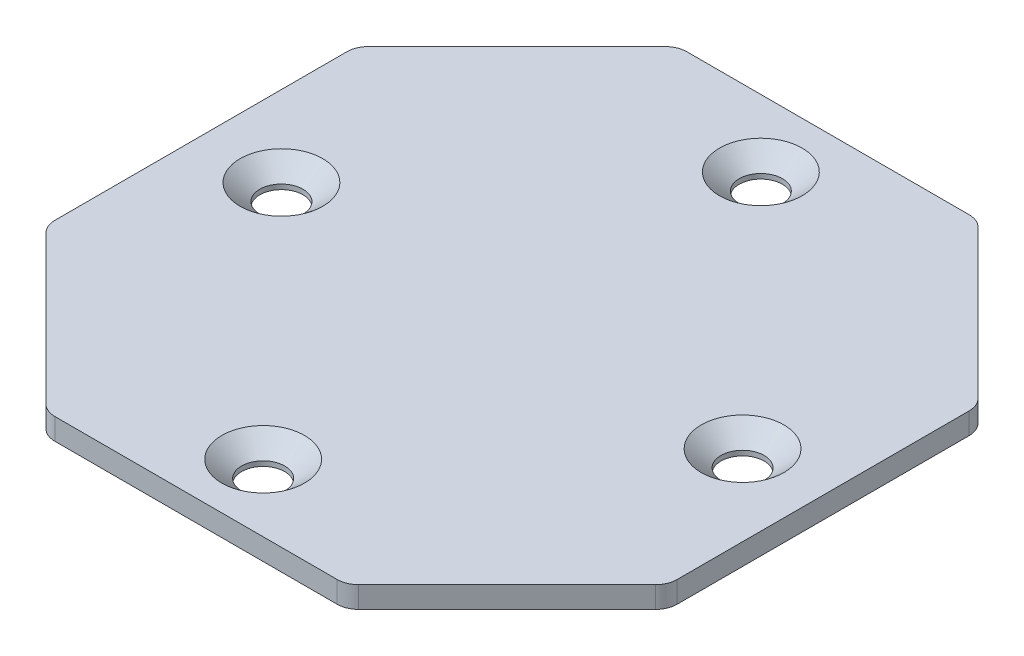
ISO-10303-21;
HEADER;
FILE_DESCRIPTION(('STEP AP214'),'2;1');
FILE_NAME('part.step','',(''),(''),'','','');
FILE_SCHEMA(('AUTOMOTIVE_DESIGN { 1 0 10303 214 1 1 1 1 }'));
ENDSEC;
DATA;
#1=APPLICATION_CONTEXT('core data for automotive mechanical design processes');
#2=APPLICATION_PROTOCOL_DEFINITION('international standard','automotive_design',2000,#1);
#3=PRODUCT_CONTEXT('',#1,'mechanical');
#4=PRODUCT('Part','Part','',(#3));
#5=PRODUCT_RELATED_PRODUCT_CATEGORY('part','',(#4));
#6=PRODUCT_DEFINITION_FORMATION('','',#4);
#7=PRODUCT_DEFINITION_CONTEXT('part definition',#1,'design');
#8=PRODUCT_DEFINITION('design','',#6,#7);
#9=PRODUCT_DEFINITION_SHAPE('','',#8);
#10=(LENGTH_UNIT() NAMED_UNIT(*) SI_UNIT(.MILLI.,.METRE.));
#11=(NAMED_UNIT(*) PLANE_ANGLE_UNIT() SI_UNIT($,.RADIAN.));
#12=(NAMED_UNIT(*) SI_UNIT($,.STERADIAN.) SOLID_ANGLE_UNIT());
#13=UNCERTAINTY_MEASURE_WITH_UNIT(LENGTH_MEASURE(1.E-05),#10,'distance_accuracy_value','');
#14=(GEOMETRIC_REPRESENTATION_CONTEXT(3) GLOBAL_UNCERTAINTY_ASSIGNED_CONTEXT((#13)) GLOBAL_UNIT_ASSIGNED_CONTEXT((#10,
#11,#12)) REPRESENTATION_CONTEXT('',''));
#15=CARTESIAN_POINT('',(0.,0.,0.));
#16=DIRECTION('',(0.,0.,1.));
#17=DIRECTION('',(1.,0.,0.));
#18=AXIS2_PLACEMENT_3D('',#15,#16,#17);
#19=CARTESIAN_POINT('',(0.,2.54,0.));
#20=DIRECTION('',(1.,0.,0.));
#21=DIRECTION('',(0.,0.,-1.));
#22=AXIS2_PLACEMENT_3D('',#19,#20,#21);
#23=PLANE('',#22);
#24=DIRECTION('',(0.,0.,1.));
#25=VECTOR('',#24,1.);
#26=CARTESIAN_POINT('',(0.,2.54,0.));
#27=LINE('',#26,#25);
#28=CARTESIAN_POINT('',(0.,2.54,-54.6478976575723));
#29=VERTEX_POINT('',#28);
#30=CARTESIAN_POINT('',(0.,2.54,-20.1021024484277));
#31=VERTEX_POINT('',#30);
#32=EDGE_CURVE('E230',#29,#31,#27,.T.);
#33=ORIENTED_EDGE('',*,*,#32,.F.);
#34=DIRECTION('',(0.,1.,0.));
#35=VECTOR('',#34,1.);
#36=CARTESIAN_POINT('',(0.,2.54,-54.6478976575723));
#37=LINE('',#36,#35);
#38=CARTESIAN_POINT('',(0.,0.,-54.6478976575723));
#39=VERTEX_POINT('',#38);
#40=EDGE_CURVE('E55',#29,#39,#37,.F.);
#41=ORIENTED_EDGE('',*,*,#40,.T.);
#42=DIRECTION('',(0.,0.,1.));
#43=VECTOR('',#42,1.);
#44=CARTESIAN_POINT('',(0.,0.,0.));
#45=LINE('',#44,#43);
#46=CARTESIAN_POINT('',(0.,0.,-20.1021024484277));
#47=VERTEX_POINT('',#46);
#48=EDGE_CURVE('E229',#39,#47,#45,.T.);
#49=ORIENTED_EDGE('',*,*,#48,.T.);
#50=DIRECTION('',(0.,1.,0.));
#51=VECTOR('',#50,1.);
#52=CARTESIAN_POINT('',(0.,2.54,-20.1021024484277));
#53=LINE('',#52,#51);
#54=EDGE_CURVE('E296',#47,#31,#53,.T.);
#55=ORIENTED_EDGE('',*,*,#54,.T.);
#56=EDGE_LOOP('',(#33,#41,#49,#55));
#57=FACE_BOUND('',#56,.T.);
#58=ADVANCED_FACE('F33',(#57),#23,.F.);
#59=CARTESIAN_POINT('',(0.,2.54,0.));
#60=DIRECTION('',(0.,0.,-1.));
#61=DIRECTION('',(-1.,0.,0.));
#62=AXIS2_PLACEMENT_3D('',#59,#60,#61);
#63=PLANE('',#62);
#64=DIRECTION('',(1.,0.,0.));
#65=VECTOR('',#64,1.);
#66=CARTESIAN_POINT('',(0.,2.54,0.));
#67=LINE('',#66,#65);
#68=CARTESIAN_POINT('',(20.1021024484277,2.54,0.));
#69=VERTEX_POINT('',#68);
#70=CARTESIAN_POINT('',(53.4978976715723,2.54,0.));
#71=VERTEX_POINT('',#70);
#72=EDGE_CURVE('E233',#69,#71,#67,.T.);
#73=ORIENTED_EDGE('',*,*,#72,.F.);
#74=DIRECTION('',(0.,1.,0.));
#75=VECTOR('',#74,1.);
#76=CARTESIAN_POINT('',(20.1021024484277,2.54,0.));
#77=LINE('',#76,#75);
#78=CARTESIAN_POINT('',(20.1021024484277,0.,0.));
#79=VERTEX_POINT('',#78);
#80=EDGE_CURVE('E11',#69,#79,#77,.F.);
#81=ORIENTED_EDGE('',*,*,#80,.T.);
#82=DIRECTION('',(1.,0.,0.));
#83=VECTOR('',#82,1.);
#84=CARTESIAN_POINT('',(0.,0.,0.));
#85=LINE('',#84,#83);
#86=CARTESIAN_POINT('',(53.4978976715723,0.,0.));
#87=VERTEX_POINT('',#86);
#88=EDGE_CURVE('E242',#79,#87,#85,.T.);
#89=ORIENTED_EDGE('',*,*,#88,.T.);
#90=DIRECTION('',(0.,1.,0.));
#91=VECTOR('',#90,1.);
#92=CARTESIAN_POINT('',(53.4978976715723,2.54,0.));
#93=LINE('',#92,#91);
#94=EDGE_CURVE('E41',#87,#71,#93,.T.);
#95=ORIENTED_EDGE('',*,*,#94,.T.);
#96=EDGE_LOOP('',(#73,#81,#89,#95));
#97=FACE_BOUND('',#96,.T.);
#98=ADVANCED_FACE('F308',(#97),#63,.F.);
#99=CARTESIAN_POINT('',(73.60000012,2.54,0.));
#100=DIRECTION('',(-1.,0.,0.));
#101=DIRECTION('',(0.,0.,1.));
#102=AXIS2_PLACEMENT_3D('',#99,#100,#101);
#103=PLANE('',#102);
#104=DIRECTION('',(0.,0.,-1.));
#105=VECTOR('',#104,1.);
#106=CARTESIAN_POINT('',(73.60000012,2.54,0.));
#107=LINE('',#106,#105);
#108=CARTESIAN_POINT('',(73.60000012,2.54,-20.1021024484277));
#109=VERTEX_POINT('',#108);
#110=CARTESIAN_POINT('',(73.60000012,2.54,-54.6478976575723));
#111=VERTEX_POINT('',#110);
#112=EDGE_CURVE('E236',#109,#111,#107,.T.);
#113=ORIENTED_EDGE('',*,*,#112,.F.);
#114=DIRECTION('',(0.,1.,0.));
#115=VECTOR('',#114,1.);
#116=CARTESIAN_POINT('',(73.60000012,2.54,-20.1021024484277));
#117=LINE('',#116,#115);
#118=CARTESIAN_POINT('',(73.60000012,0.,-20.1021024484277));
#119=VERTEX_POINT('',#118);
#120=EDGE_CURVE('E152',#109,#119,#117,.F.);
#121=ORIENTED_EDGE('',*,*,#120,.T.);
#122=DIRECTION('',(0.,0.,-1.));
#123=VECTOR('',#122,1.);
#124=CARTESIAN_POINT('',(73.60000012,0.,0.));
#125=LINE('',#124,#123);
#126=CARTESIAN_POINT('',(73.60000012,0.,-54.6478976575723));
#127=VERTEX_POINT('',#126);
#128=EDGE_CURVE('E245',#119,#127,#125,.T.);
#129=ORIENTED_EDGE('',*,*,#128,.T.);
#130=DIRECTION('',(0.,1.,0.));
#131=VECTOR('',#130,1.);
#132=CARTESIAN_POINT('',(73.60000012,2.54,-54.6478976575723));
#133=LINE('',#132,#131);
#134=EDGE_CURVE('E157',#127,#111,#133,.T.);
#135=ORIENTED_EDGE('',*,*,#134,.T.);
#136=EDGE_LOOP('',(#113,#121,#129,#135));
#137=FACE_BOUND('',#136,.T.);
#138=ADVANCED_FACE('F360',(#137),#103,.F.);
#139=CARTESIAN_POINT('',(0.,2.54,-74.750000106));
#140=DIRECTION('',(0.,0.,1.));
#141=DIRECTION('',(1.,0.,0.));
#142=AXIS2_PLACEMENT_3D('',#139,#140,#141);
#143=PLANE('',#142);
#144=DIRECTION('',(-1.,0.,0.));
#145=VECTOR('',#144,1.);
#146=CARTESIAN_POINT('',(0.,2.54,-74.750000106));
#147=LINE('',#146,#145);
#148=CARTESIAN_POINT('',(53.4978976715723,2.54,-74.750000106));
#149=VERTEX_POINT('',#148);
#150=CARTESIAN_POINT('',(20.1021024484277,2.54,-74.750000106));
#151=VERTEX_POINT('',#150);
#152=EDGE_CURVE('E238',#149,#151,#147,.T.);
#153=ORIENTED_EDGE('',*,*,#152,.F.);
#154=DIRECTION('',(0.,1.,0.));
#155=VECTOR('',#154,1.);
#156=CARTESIAN_POINT('',(53.4978976715723,2.54,-74.750000106));
#157=LINE('',#156,#155);
#158=CARTESIAN_POINT('',(53.4978976715723,0.,-74.750000106));
#159=VERTEX_POINT('',#158);
#160=EDGE_CURVE('E289',#149,#159,#157,.F.);
#161=ORIENTED_EDGE('',*,*,#160,.T.);
#162=DIRECTION('',(-1.,0.,0.));
#163=VECTOR('',#162,1.);
#164=CARTESIAN_POINT('',(0.,0.,-74.750000106));
#165=LINE('',#164,#163);
#166=CARTESIAN_POINT('',(20.1021024484277,0.,-74.750000106));
#167=VERTEX_POINT('',#166);
#168=EDGE_CURVE('E234',#159,#167,#165,.T.);
#169=ORIENTED_EDGE('',*,*,#168,.T.);
#170=DIRECTION('',(0.,1.,0.));
#171=VECTOR('',#170,1.);
#172=CARTESIAN_POINT('',(20.1021024484277,2.54,-74.750000106));
#173=LINE('',#172,#171);
#174=EDGE_CURVE('E286',#167,#151,#173,.T.);
#175=ORIENTED_EDGE('',*,*,#174,.T.);
#176=EDGE_LOOP('',(#153,#161,#169,#175));
#177=FACE_BOUND('',#176,.T.);
#178=ADVANCED_FACE('F344',(#177),#143,.F.);
#179=CARTESIAN_POINT('',(0.,2.54,0.));
#180=DIRECTION('',(0.,-1.,0.));
#181=DIRECTION('',(0.,0.,-1.));
#182=AXIS2_PLACEMENT_3D('',#179,#180,#181);
#183=PLANE('',#182);
#184=CARTESIAN_POINT('',(9.52500003,2.54,-37.375000053));
#185=DIRECTION('',(0.,1.,0.));
#186=DIRECTION('',(0.,0.,1.));
#187=AXIS2_PLACEMENT_3D('',#184,#185,#186);
#188=CIRCLE('',#187,4.8895);
#189=CARTESIAN_POINT('',(9.52500003,2.54,-32.485500053));
#190=VERTEX_POINT('',#189);
#191=EDGE_CURVE('E193',#190,#190,#188,.T.);
#192=ORIENTED_EDGE('',*,*,#191,.F.);
#193=EDGE_LOOP('',(#192));
#194=FACE_BOUND('',#193,.T.);
#195=CARTESIAN_POINT('',(36.80000006,2.54,-7.9375000265));
#196=DIRECTION('',(0.,1.,0.));
#197=DIRECTION('',(0.,0.,1.));
#198=AXIS2_PLACEMENT_3D('',#195,#196,#197);
#199=CIRCLE('',#198,4.8895);
#200=CARTESIAN_POINT('',(36.80000006,2.54,-3.0480000265));
#201=VERTEX_POINT('',#200);
#202=EDGE_CURVE('E202',#201,#201,#199,.T.);
#203=ORIENTED_EDGE('',*,*,#202,.F.);
#204=EDGE_LOOP('',(#203));
#205=FACE_BOUND('',#204,.T.);
#206=CARTESIAN_POINT('',(64.07500009,2.54,-37.375000053));
#207=DIRECTION('',(0.,1.,0.));
#208=DIRECTION('',(0.,0.,1.));
#209=AXIS2_PLACEMENT_3D('',#206,#207,#208);
#210=CIRCLE('',#209,4.88950000000001);
#211=CARTESIAN_POINT('',(64.07500009,2.54,-32.485500053));
#212=VERTEX_POINT('',#211);
#213=EDGE_CURVE('E211',#212,#212,#210,.T.);
#214=ORIENTED_EDGE('',*,*,#213,.F.);
#215=EDGE_LOOP('',(#214));
#216=FACE_BOUND('',#215,.T.);
#217=CARTESIAN_POINT('',(36.80000006,2.54,-66.8125000795));
#218=DIRECTION('',(0.,1.,0.));
#219=DIRECTION('',(0.,0.,1.));
#220=AXIS2_PLACEMENT_3D('',#217,#218,#219);
#221=CIRCLE('',#220,4.8895);
#222=CARTESIAN_POINT('',(36.80000006,2.54,-61.9230000795));
#223=VERTEX_POINT('',#222);
#224=EDGE_CURVE('E220',#223,#223,#221,.T.);
#225=ORIENTED_EDGE('',*,*,#224,.F.);
#226=EDGE_LOOP('',(#225));
#227=FACE_BOUND('',#226,.T.);
#228=DIRECTION('',(-0.707106781186547,0.,0.707106781186548));
#229=VECTOR('',#228,1.);
#230=CARTESIAN_POINT('',(73.60000012,2.54,-19.05));
#231=LINE('',#230,#229);
#232=CARTESIAN_POINT('',(72.8560513442138,2.54,-18.3060512242138));
#233=VERTEX_POINT('',#232);
#234=CARTESIAN_POINT('',(55.2939488957862,2.54,-0.743948775786166));
#235=VERTEX_POINT('',#234);
#236=EDGE_CURVE('E164',#233,#235,#231,.T.);
#237=ORIENTED_EDGE('',*,*,#236,.F.);
#238=CARTESIAN_POINT('',(71.06000012,2.54,-20.1021024484277));
#239=DIRECTION('',(0.,-1.,0.));
#240=DIRECTION('',(0.,0.,-1.));
#241=AXIS2_PLACEMENT_3D('',#238,#239,#240);
#242=CIRCLE('',#241,2.54);
#243=EDGE_CURVE('E147',#233,#109,#242,.F.);
#244=ORIENTED_EDGE('',*,*,#243,.T.);
#245=ORIENTED_EDGE('',*,*,#112,.T.);
#246=CARTESIAN_POINT('',(71.06000012,2.54,-54.6478976575723));
#247=DIRECTION('',(0.,-1.,0.));
#248=DIRECTION('',(0.,0.,-1.));
#249=AXIS2_PLACEMENT_3D('',#246,#247,#248);
#250=CIRCLE('',#249,2.54);
#251=CARTESIAN_POINT('',(72.8560513442138,2.54,-56.4439488817862));
#252=VERTEX_POINT('',#251);
#253=EDGE_CURVE('E158',#111,#252,#250,.F.);
#254=ORIENTED_EDGE('',*,*,#253,.T.);
#255=DIRECTION('',(0.707106781186548,0.,0.707106781186548));
#256=VECTOR('',#255,1.);
#257=CARTESIAN_POINT('',(73.60000012,2.54,-55.700000106));
#258=LINE('',#257,#256);
#259=CARTESIAN_POINT('',(55.2939488957862,2.54,-74.0060513302138));
#260=VERTEX_POINT('',#259);
#261=EDGE_CURVE('E178',#260,#252,#258,.T.);
#262=ORIENTED_EDGE('',*,*,#261,.F.);
#263=CARTESIAN_POINT('',(53.4978976715723,2.54,-72.210000106));
#264=DIRECTION('',(0.,-1.,0.));
#265=DIRECTION('',(0.,0.,-1.));
#266=AXIS2_PLACEMENT_3D('',#263,#264,#265);
#267=CIRCLE('',#266,2.54);
#268=EDGE_CURVE('E260',#260,#149,#267,.F.);
#269=ORIENTED_EDGE('',*,*,#268,.T.);
#270=ORIENTED_EDGE('',*,*,#152,.T.);
#271=CARTESIAN_POINT('',(20.1021024484277,2.54,-72.210000106));
#272=DIRECTION('',(0.,-1.,0.));
#273=DIRECTION('',(0.,0.,-1.));
#274=AXIS2_PLACEMENT_3D('',#271,#272,#273);
#275=CIRCLE('',#274,2.54);
#276=CARTESIAN_POINT('',(18.3060512242138,2.54,-74.0060513302138));
#277=VERTEX_POINT('',#276);
#278=EDGE_CURVE('E258',#151,#277,#275,.F.);
#279=ORIENTED_EDGE('',*,*,#278,.T.);
#280=DIRECTION('',(0.707106781186547,0.,-0.707106781186548));
#281=VECTOR('',#280,1.);
#282=CARTESIAN_POINT('',(0.,2.54,-55.700000106));
#283=LINE('',#282,#281);
#284=CARTESIAN_POINT('',(0.743948775786166,2.54,-56.4439488817862));
#285=VERTEX_POINT('',#284);
#286=EDGE_CURVE('E184',#285,#277,#283,.T.);
#287=ORIENTED_EDGE('',*,*,#286,.F.);
#288=CARTESIAN_POINT('',(2.54,2.54,-54.6478976575723));
#289=DIRECTION('',(0.,-1.,0.));
#290=DIRECTION('',(0.,0.,-1.));
#291=AXIS2_PLACEMENT_3D('',#288,#289,#290);
#292=CIRCLE('',#291,2.54);
#293=EDGE_CURVE('E256',#285,#29,#292,.F.);
#294=ORIENTED_EDGE('',*,*,#293,.T.);
#295=ORIENTED_EDGE('',*,*,#32,.T.);
#296=CARTESIAN_POINT('',(2.54,2.54,-20.1021024484277));
#297=DIRECTION('',(0.,-1.,0.));
#298=DIRECTION('',(0.,0.,-1.));
#299=AXIS2_PLACEMENT_3D('',#296,#297,#298);
#300=CIRCLE('',#299,2.54);
#301=CARTESIAN_POINT('',(0.743948775786169,2.54,-18.3060512242138));
#302=VERTEX_POINT('',#301);
#303=EDGE_CURVE('E254',#31,#302,#300,.F.);
#304=ORIENTED_EDGE('',*,*,#303,.T.);
#305=DIRECTION('',(-0.707106781186547,0.,-0.707106781186547));
#306=VECTOR('',#305,1.);
#307=CARTESIAN_POINT('',(0.,2.54,-19.05));
#308=LINE('',#307,#306);
#309=CARTESIAN_POINT('',(18.3060512242138,2.54,-0.743948775786173));
#310=VERTEX_POINT('',#309);
#311=EDGE_CURVE('E175',#310,#302,#308,.T.);
#312=ORIENTED_EDGE('',*,*,#311,.F.);
#313=CARTESIAN_POINT('',(20.1021024484277,2.54,-2.54));
#314=DIRECTION('',(0.,-1.,0.));
#315=DIRECTION('',(0.,0.,-1.));
#316=AXIS2_PLACEMENT_3D('',#313,#314,#315);
#317=CIRCLE('',#316,2.54);
#318=EDGE_CURVE('E252',#310,#69,#317,.F.);
#319=ORIENTED_EDGE('',*,*,#318,.T.);
#320=ORIENTED_EDGE('',*,*,#72,.T.);
#321=CARTESIAN_POINT('',(53.4978976715723,2.54,-2.54));
#322=DIRECTION('',(0.,-1.,0.));
#323=DIRECTION('',(0.,0.,-1.));
#324=AXIS2_PLACEMENT_3D('',#321,#322,#323);
#325=CIRCLE('',#324,2.54);
#326=EDGE_CURVE('E168',#71,#235,#325,.F.);
#327=ORIENTED_EDGE('',*,*,#326,.T.);
#328=EDGE_LOOP('',(#237,#244,#245,#254,#262,#269,#270,#279,#287,#294,#295,#304,#312,#319,#320,#327));
#329=FACE_BOUND('',#328,.T.);
#330=ADVANCED_FACE('F171',(#194,#205,#216,#227,#329),#183,.F.);
#331=CARTESIAN_POINT('',(0.,0.,0.));
#332=DIRECTION('',(0.,-1.,0.));
#333=DIRECTION('',(0.,0.,-1.));
#334=AXIS2_PLACEMENT_3D('',#331,#332,#333);
#335=PLANE('',#334);
#336=ORIENTED_EDGE('',*,*,#128,.F.);
#337=CARTESIAN_POINT('',(71.06000012,0.,-20.1021024484277));
#338=DIRECTION('',(0.,-1.,0.));
#339=DIRECTION('',(0.,0.,-1.));
#340=AXIS2_PLACEMENT_3D('',#337,#338,#339);
#341=CIRCLE('',#340,2.54);
#342=CARTESIAN_POINT('',(72.8560513442138,0.,-18.3060512242138));
#343=VERTEX_POINT('',#342);
#344=EDGE_CURVE('E279',#119,#343,#341,.T.);
#345=ORIENTED_EDGE('',*,*,#344,.T.);
#346=DIRECTION('',(-0.707106781186547,0.,0.707106781186548));
#347=VECTOR('',#346,1.);
#348=CARTESIAN_POINT('',(73.60000012,0.,-19.05));
#349=LINE('',#348,#347);
#350=CARTESIAN_POINT('',(55.2939488957862,0.,-0.743948775786162));
#351=VERTEX_POINT('',#350);
#352=EDGE_CURVE('E167',#343,#351,#349,.T.);
#353=ORIENTED_EDGE('',*,*,#352,.T.);
#354=CARTESIAN_POINT('',(53.4978976715723,0.,-2.54));
#355=DIRECTION('',(0.,-1.,0.));
#356=DIRECTION('',(0.,0.,-1.));
#357=AXIS2_PLACEMENT_3D('',#354,#355,#356);
#358=CIRCLE('',#357,2.54);
#359=EDGE_CURVE('E266',#351,#87,#358,.T.);
#360=ORIENTED_EDGE('',*,*,#359,.T.);
#361=ORIENTED_EDGE('',*,*,#88,.F.);
#362=CARTESIAN_POINT('',(20.1021024484277,0.,-2.54));
#363=DIRECTION('',(0.,-1.,0.));
#364=DIRECTION('',(0.,0.,-1.));
#365=AXIS2_PLACEMENT_3D('',#362,#363,#364);
#366=CIRCLE('',#365,2.54);
#367=CARTESIAN_POINT('',(18.3060512242138,0.,-0.743948775786166));
#368=VERTEX_POINT('',#367);
#369=EDGE_CURVE('E268',#79,#368,#366,.T.);
#370=ORIENTED_EDGE('',*,*,#369,.T.);
#371=DIRECTION('',(-0.707106781186548,0.,-0.707106781186548));
#372=VECTOR('',#371,1.);
#373=CARTESIAN_POINT('',(0.,0.,-19.05));
#374=LINE('',#373,#372);
#375=CARTESIAN_POINT('',(0.743948775786169,0.,-18.3060512242138));
#376=VERTEX_POINT('',#375);
#377=EDGE_CURVE('E191',#368,#376,#374,.T.);
#378=ORIENTED_EDGE('',*,*,#377,.T.);
#379=CARTESIAN_POINT('',(2.54,0.,-20.1021024484277));
#380=DIRECTION('',(0.,-1.,0.));
#381=DIRECTION('',(0.,0.,-1.));
#382=AXIS2_PLACEMENT_3D('',#379,#380,#381);
#383=CIRCLE('',#382,2.54);
#384=EDGE_CURVE('E48',#376,#47,#383,.T.);
#385=ORIENTED_EDGE('',*,*,#384,.T.);
#386=ORIENTED_EDGE('',*,*,#48,.F.);
#387=CARTESIAN_POINT('',(2.54,0.,-54.6478976575723));
#388=DIRECTION('',(0.,-1.,0.));
#389=DIRECTION('',(0.,0.,-1.));
#390=AXIS2_PLACEMENT_3D('',#387,#388,#389);
#391=CIRCLE('',#390,2.54);
#392=CARTESIAN_POINT('',(0.743948775786166,0.,-56.4439488817862));
#393=VERTEX_POINT('',#392);
#394=EDGE_CURVE('E271',#39,#393,#391,.T.);
#395=ORIENTED_EDGE('',*,*,#394,.T.);
#396=DIRECTION('',(0.707106781186547,0.,-0.707106781186548));
#397=VECTOR('',#396,1.);
#398=CARTESIAN_POINT('',(0.,0.,-55.700000106));
#399=LINE('',#398,#397);
#400=CARTESIAN_POINT('',(18.3060512242138,0.,-74.0060513302138));
#401=VERTEX_POINT('',#400);
#402=EDGE_CURVE('E182',#393,#401,#399,.T.);
#403=ORIENTED_EDGE('',*,*,#402,.T.);
#404=CARTESIAN_POINT('',(20.1021024484277,0.,-72.210000106));
#405=DIRECTION('',(0.,-1.,0.));
#406=DIRECTION('',(0.,0.,-1.));
#407=AXIS2_PLACEMENT_3D('',#404,#405,#406);
#408=CIRCLE('',#407,2.54);
#409=EDGE_CURVE('E273',#401,#167,#408,.T.);
#410=ORIENTED_EDGE('',*,*,#409,.T.);
#411=ORIENTED_EDGE('',*,*,#168,.F.);
#412=CARTESIAN_POINT('',(53.4978976715723,0.,-72.210000106));
#413=DIRECTION('',(0.,-1.,0.));
#414=DIRECTION('',(0.,0.,-1.));
#415=AXIS2_PLACEMENT_3D('',#412,#413,#414);
#416=CIRCLE('',#415,2.54);
#417=CARTESIAN_POINT('',(55.2939488957862,0.,-74.0060513302138));
#418=VERTEX_POINT('',#417);
#419=EDGE_CURVE('E275',#159,#418,#416,.T.);
#420=ORIENTED_EDGE('',*,*,#419,.T.);
#421=DIRECTION('',(0.707106781186548,0.,0.707106781186548));
#422=VECTOR('',#421,1.);
#423=CARTESIAN_POINT('',(73.60000012,0.,-55.700000106));
#424=LINE('',#423,#422);
#425=CARTESIAN_POINT('',(72.8560513442138,0.,-56.4439488817862));
#426=VERTEX_POINT('',#425);
#427=EDGE_CURVE('E173',#418,#426,#424,.T.);
#428=ORIENTED_EDGE('',*,*,#427,.T.);
#429=CARTESIAN_POINT('',(71.06000012,0.,-54.6478976575723));
#430=DIRECTION('',(0.,-1.,0.));
#431=DIRECTION('',(0.,0.,-1.));
#432=AXIS2_PLACEMENT_3D('',#429,#430,#431);
#433=CIRCLE('',#432,2.54);
#434=EDGE_CURVE('E277',#426,#127,#433,.T.);
#435=ORIENTED_EDGE('',*,*,#434,.T.);
#436=EDGE_LOOP('',(#336,#345,#353,#360,#361,#370,#378,#385,#386,#395,#403,#410,#411,#420,#428,#435));
#437=FACE_BOUND('',#436,.T.);
#438=CARTESIAN_POINT('',(9.52500003,0.,-37.375000053));
#439=DIRECTION('',(0.,1.,0.));
#440=DIRECTION('',(0.,0.,1.));
#441=AXIS2_PLACEMENT_3D('',#438,#439,#440);
#442=CIRCLE('',#441,2.5527);
#443=CARTESIAN_POINT('',(9.52500003,0.,-34.822300053));
#444=VERTEX_POINT('',#443);
#445=EDGE_CURVE('E199',#444,#444,#442,.T.);
#446=ORIENTED_EDGE('',*,*,#445,.T.);
#447=EDGE_LOOP('',(#446));
#448=FACE_BOUND('',#447,.T.);
#449=CARTESIAN_POINT('',(36.80000006,0.,-7.9375000265));
#450=DIRECTION('',(0.,1.,0.));
#451=DIRECTION('',(0.,0.,1.));
#452=AXIS2_PLACEMENT_3D('',#449,#450,#451);
#453=CIRCLE('',#452,2.5527);
#454=CARTESIAN_POINT('',(36.80000006,0.,-5.3848000265));
#455=VERTEX_POINT('',#454);
#456=EDGE_CURVE('E208',#455,#455,#453,.T.);
#457=ORIENTED_EDGE('',*,*,#456,.T.);
#458=EDGE_LOOP('',(#457));
#459=FACE_BOUND('',#458,.T.);
#460=CARTESIAN_POINT('',(64.07500009,0.,-37.375000053));
#461=DIRECTION('',(0.,1.,0.));
#462=DIRECTION('',(0.,0.,1.));
#463=AXIS2_PLACEMENT_3D('',#460,#461,#462);
#464=CIRCLE('',#463,2.55270000000001);
#465=CARTESIAN_POINT('',(64.07500009,0.,-34.822300053));
#466=VERTEX_POINT('',#465);
#467=EDGE_CURVE('E217',#466,#466,#464,.T.);
#468=ORIENTED_EDGE('',*,*,#467,.T.);
#469=EDGE_LOOP('',(#468));
#470=FACE_BOUND('',#469,.T.);
#471=CARTESIAN_POINT('',(36.80000006,0.,-66.8125000795));
#472=DIRECTION('',(0.,1.,0.));
#473=DIRECTION('',(0.,0.,1.));
#474=AXIS2_PLACEMENT_3D('',#471,#472,#473);
#475=CIRCLE('',#474,2.5527);
#476=CARTESIAN_POINT('',(36.80000006,0.,-64.2598000795));
#477=VERTEX_POINT('',#476);
#478=EDGE_CURVE('E226',#477,#477,#475,.T.);
#479=ORIENTED_EDGE('',*,*,#478,.T.);
#480=EDGE_LOOP('',(#479));
#481=FACE_BOUND('',#480,.T.);
#482=ADVANCED_FACE('F323',(#437,#448,#459,#470,#481),#335,.T.);
#483=CARTESIAN_POINT('',(36.80000006,2.54,-66.8125000795));
#484=DIRECTION('',(0.,1.,0.));
#485=DIRECTION('',(0.,0.,1.));
#486=AXIS2_PLACEMENT_3D('',#483,#484,#485);
#487=CYLINDRICAL_SURFACE('',#486,2.5527);
#488=ORIENTED_EDGE('',*,*,#478,.F.);
#489=EDGE_LOOP('',(#488));
#490=FACE_BOUND('',#489,.T.);
#491=CARTESIAN_POINT('',(36.80000006,0.579191981864934,-66.8125000795));
#492=DIRECTION('',(0.,1.,0.));
#493=DIRECTION('',(0.,0.,1.));
#494=AXIS2_PLACEMENT_3D('',#491,#492,#493);
#495=CIRCLE('',#494,2.5527);
#496=CARTESIAN_POINT('',(36.80000006,0.579191981864934,-64.2598000795));
#497=VERTEX_POINT('',#496);
#498=EDGE_CURVE('E223',#497,#497,#495,.T.);
#499=ORIENTED_EDGE('',*,*,#498,.T.);
#500=EDGE_LOOP('',(#499));
#501=FACE_BOUND('',#500,.T.);
#502=ADVANCED_FACE('F516',(#490,#501),#487,.F.);
#503=CARTESIAN_POINT('',(36.80000006,2.54,-66.8125000795));
#504=DIRECTION('',(0.,1.,0.));
#505=DIRECTION('',(0.,0.,1.));
#506=AXIS2_PLACEMENT_3D('',#503,#504,#505);
#507=CONICAL_SURFACE('',#506,4.8895,0.872664625997165);
#508=ORIENTED_EDGE('',*,*,#498,.F.);
#509=EDGE_LOOP('',(#508));
#510=FACE_BOUND('',#509,.T.);
#511=ORIENTED_EDGE('',*,*,#224,.T.);
#512=EDGE_LOOP('',(#511));
#513=FACE_BOUND('',#512,.T.);
#514=ADVANCED_FACE('F507',(#510,#513),#507,.F.);
#515=CARTESIAN_POINT('',(64.07500009,2.54,-37.375000053));
#516=DIRECTION('',(0.,1.,0.));
#517=DIRECTION('',(0.,0.,1.));
#518=AXIS2_PLACEMENT_3D('',#515,#516,#517);
#519=CYLINDRICAL_SURFACE('',#518,2.55270000000001);
#520=ORIENTED_EDGE('',*,*,#467,.F.);
#521=EDGE_LOOP('',(#520));
#522=FACE_BOUND('',#521,.T.);
#523=CARTESIAN_POINT('',(64.07500009,0.579191981864934,-37.375000053));
#524=DIRECTION('',(0.,1.,0.));
#525=DIRECTION('',(0.,0.,1.));
#526=AXIS2_PLACEMENT_3D('',#523,#524,#525);
#527=CIRCLE('',#526,2.55270000000001);
#528=CARTESIAN_POINT('',(64.07500009,0.579191981864934,-34.822300053));
#529=VERTEX_POINT('',#528);
#530=EDGE_CURVE('E214',#529,#529,#527,.T.);
#531=ORIENTED_EDGE('',*,*,#530,.T.);
#532=EDGE_LOOP('',(#531));
#533=FACE_BOUND('',#532,.T.);
#534=ADVANCED_FACE('F498',(#522,#533),#519,.F.);
#535=CARTESIAN_POINT('',(64.07500009,2.54,-37.375000053));
#536=DIRECTION('',(0.,1.,0.));
#537=DIRECTION('',(0.,0.,1.));
#538=AXIS2_PLACEMENT_3D('',#535,#536,#537);
#539=CONICAL_SURFACE('',#538,4.88950000000001,0.872664625997165);
#540=ORIENTED_EDGE('',*,*,#530,.F.);
#541=EDGE_LOOP('',(#540));
#542=FACE_BOUND('',#541,.T.);
#543=ORIENTED_EDGE('',*,*,#213,.T.);
#544=EDGE_LOOP('',(#543));
#545=FACE_BOUND('',#544,.T.);
#546=ADVANCED_FACE('F489',(#542,#545),#539,.F.);
#547=CARTESIAN_POINT('',(36.80000006,2.54,-7.9375000265));
#548=DIRECTION('',(0.,1.,0.));
#549=DIRECTION('',(0.,0.,1.));
#550=AXIS2_PLACEMENT_3D('',#547,#548,#549);
#551=CYLINDRICAL_SURFACE('',#550,2.5527);
#552=ORIENTED_EDGE('',*,*,#456,.F.);
#553=EDGE_LOOP('',(#552));
#554=FACE_BOUND('',#553,.T.);
#555=CARTESIAN_POINT('',(36.80000006,0.579191981864934,-7.9375000265));
#556=DIRECTION('',(0.,1.,0.));
#557=DIRECTION('',(0.,0.,1.));
#558=AXIS2_PLACEMENT_3D('',#555,#556,#557);
#559=CIRCLE('',#558,2.5527);
#560=CARTESIAN_POINT('',(36.80000006,0.579191981864934,-5.3848000265));
#561=VERTEX_POINT('',#560);
#562=EDGE_CURVE('E205',#561,#561,#559,.T.);
#563=ORIENTED_EDGE('',*,*,#562,.T.);
#564=EDGE_LOOP('',(#563));
#565=FACE_BOUND('',#564,.T.);
#566=ADVANCED_FACE('F480',(#554,#565),#551,.F.);
#567=CARTESIAN_POINT('',(36.80000006,2.54,-7.9375000265));
#568=DIRECTION('',(0.,1.,0.));
#569=DIRECTION('',(0.,0.,1.));
#570=AXIS2_PLACEMENT_3D('',#567,#568,#569);
#571=CONICAL_SURFACE('',#570,4.8895,0.872664625997165);
#572=ORIENTED_EDGE('',*,*,#562,.F.);
#573=EDGE_LOOP('',(#572));
#574=FACE_BOUND('',#573,.T.);
#575=ORIENTED_EDGE('',*,*,#202,.T.);
#576=EDGE_LOOP('',(#575));
#577=FACE_BOUND('',#576,.T.);
#578=ADVANCED_FACE('F471',(#574,#577),#571,.F.);
#579=CARTESIAN_POINT('',(9.52500003,2.54,-37.375000053));
#580=DIRECTION('',(0.,1.,0.));
#581=DIRECTION('',(0.,0.,1.));
#582=AXIS2_PLACEMENT_3D('',#579,#580,#581);
#583=CYLINDRICAL_SURFACE('',#582,2.5527);
#584=ORIENTED_EDGE('',*,*,#445,.F.);
#585=EDGE_LOOP('',(#584));
#586=FACE_BOUND('',#585,.T.);
#587=CARTESIAN_POINT('',(9.52500003,0.579191981864934,-37.375000053));
#588=DIRECTION('',(0.,1.,0.));
#589=DIRECTION('',(0.,0.,1.));
#590=AXIS2_PLACEMENT_3D('',#587,#588,#589);
#591=CIRCLE('',#590,2.5527);
#592=CARTESIAN_POINT('',(9.52500003,0.579191981864934,-34.822300053));
#593=VERTEX_POINT('',#592);
#594=EDGE_CURVE('E196',#593,#593,#591,.T.);
#595=ORIENTED_EDGE('',*,*,#594,.T.);
#596=EDGE_LOOP('',(#595));
#597=FACE_BOUND('',#596,.T.);
#598=ADVANCED_FACE('F462',(#586,#597),#583,.F.);
#599=CARTESIAN_POINT('',(9.52500003,2.54,-37.375000053));
#600=DIRECTION('',(0.,1.,0.));
#601=DIRECTION('',(0.,0.,1.));
#602=AXIS2_PLACEMENT_3D('',#599,#600,#601);
#603=CONICAL_SURFACE('',#602,4.8895,0.872664625997165);
#604=ORIENTED_EDGE('',*,*,#594,.F.);
#605=EDGE_LOOP('',(#604));
#606=FACE_BOUND('',#605,.T.);
#607=ORIENTED_EDGE('',*,*,#191,.T.);
#608=EDGE_LOOP('',(#607));
#609=FACE_BOUND('',#608,.T.);
#610=ADVANCED_FACE('F453',(#606,#609),#603,.F.);
#611=CARTESIAN_POINT('',(0.,-26.9407683632075,-19.05));
#612=DIRECTION('',(0.707106781186548,0.,-0.707106781186548));
#613=DIRECTION('',(-0.707106781186548,0.,-0.707106781186548));
#614=AXIS2_PLACEMENT_3D('',#611,#612,#613);
#615=PLANE('',#614);
#616=ORIENTED_EDGE('',*,*,#311,.T.);
#617=DIRECTION('',(0.,1.,0.));
#618=VECTOR('',#617,1.);
#619=CARTESIAN_POINT('',(0.743948775786169,-26.9407683632075,-18.3060512242138));
#620=LINE('',#619,#618);
#621=EDGE_CURVE('E303',#302,#376,#620,.F.);
#622=ORIENTED_EDGE('',*,*,#621,.T.);
#623=ORIENTED_EDGE('',*,*,#377,.F.);
#624=DIRECTION('',(0.,1.,0.));
#625=VECTOR('',#624,1.);
#626=CARTESIAN_POINT('',(18.3060512242138,-26.9407683632075,-0.743948775786173));
#627=LINE('',#626,#625);
#628=EDGE_CURVE('E300',#368,#310,#627,.T.);
#629=ORIENTED_EDGE('',*,*,#628,.T.);
#630=EDGE_LOOP('',(#616,#622,#623,#629));
#631=FACE_BOUND('',#630,.T.);
#632=ADVANCED_FACE('F320',(#631),#615,.F.);
#633=CARTESIAN_POINT('',(73.60000012,-26.9407683632075,-19.05));
#634=DIRECTION('',(-0.707106781186548,0.,-0.707106781186547));
#635=DIRECTION('',(-0.707106781186547,0.,0.707106781186548));
#636=AXIS2_PLACEMENT_3D('',#633,#634,#635);
#637=PLANE('',#636);
#638=ORIENTED_EDGE('',*,*,#352,.F.);
#639=DIRECTION('',(0.,1.,0.));
#640=VECTOR('',#639,1.);
#641=CARTESIAN_POINT('',(72.8560513442138,-26.9407683632075,-18.3060512242138));
#642=LINE('',#641,#640);
#643=EDGE_CURVE('E151',#343,#233,#642,.T.);
#644=ORIENTED_EDGE('',*,*,#643,.T.);
#645=ORIENTED_EDGE('',*,*,#236,.T.);
#646=DIRECTION('',(0.,1.,0.));
#647=VECTOR('',#646,1.);
#648=CARTESIAN_POINT('',(55.2939488957862,-26.9407683632075,-0.743948775786162));
#649=LINE('',#648,#647);
#650=EDGE_CURVE('E169',#235,#351,#649,.F.);
#651=ORIENTED_EDGE('',*,*,#650,.T.);
#652=EDGE_LOOP('',(#638,#644,#645,#651));
#653=FACE_BOUND('',#652,.T.);
#654=ADVANCED_FACE('F163',(#653),#637,.F.);
#655=CARTESIAN_POINT('',(73.60000012,-26.9407683632075,-55.700000106));
#656=DIRECTION('',(-0.707106781186548,0.,0.707106781186548));
#657=DIRECTION('',(0.707106781186548,0.,0.707106781186548));
#658=AXIS2_PLACEMENT_3D('',#655,#656,#657);
#659=PLANE('',#658);
#660=ORIENTED_EDGE('',*,*,#261,.T.);
#661=DIRECTION('',(0.,1.,0.));
#662=VECTOR('',#661,1.);
#663=CARTESIAN_POINT('',(72.8560513442138,-26.9407683632075,-56.4439488817862));
#664=LINE('',#663,#662);
#665=EDGE_CURVE('E284',#252,#426,#664,.F.);
#666=ORIENTED_EDGE('',*,*,#665,.T.);
#667=ORIENTED_EDGE('',*,*,#427,.F.);
#668=DIRECTION('',(0.,1.,0.));
#669=VECTOR('',#668,1.);
#670=CARTESIAN_POINT('',(55.2939488957862,-26.9407683632075,-74.0060513302138));
#671=LINE('',#670,#669);
#672=EDGE_CURVE('E281',#418,#260,#671,.T.);
#673=ORIENTED_EDGE('',*,*,#672,.T.);
#674=EDGE_LOOP('',(#660,#666,#667,#673));
#675=FACE_BOUND('',#674,.T.);
#676=ADVANCED_FACE('F353',(#675),#659,.F.);
#677=CARTESIAN_POINT('',(0.,-26.9407683632075,-55.700000106));
#678=DIRECTION('',(0.707106781186548,0.,0.707106781186547));
#679=DIRECTION('',(0.707106781186547,0.,-0.707106781186548));
#680=AXIS2_PLACEMENT_3D('',#677,#678,#679);
#681=PLANE('',#680);
#682=ORIENTED_EDGE('',*,*,#286,.T.);
#683=DIRECTION('',(0.,1.,0.));
#684=VECTOR('',#683,1.);
#685=CARTESIAN_POINT('',(18.3060512242138,-26.9407683632075,-74.0060513302138));
#686=LINE('',#685,#684);
#687=EDGE_CURVE('E294',#277,#401,#686,.F.);
#688=ORIENTED_EDGE('',*,*,#687,.T.);
#689=ORIENTED_EDGE('',*,*,#402,.F.);
#690=DIRECTION('',(0.,1.,0.));
#691=VECTOR('',#690,1.);
#692=CARTESIAN_POINT('',(0.743948775786167,-26.9407683632075,-56.4439488817862));
#693=LINE('',#692,#691);
#694=EDGE_CURVE('E291',#393,#285,#693,.T.);
#695=ORIENTED_EDGE('',*,*,#694,.T.);
#696=EDGE_LOOP('',(#682,#688,#689,#695));
#697=FACE_BOUND('',#696,.T.);
#698=ADVANCED_FACE('F335',(#697),#681,.F.);
#699=CARTESIAN_POINT('',(71.06000012,-26.9407683632075,-20.1021024484277));
#700=DIRECTION('',(0.,1.,0.));
#701=DIRECTION('',(0.,0.,1.));
#702=AXIS2_PLACEMENT_3D('',#699,#700,#701);
#703=CYLINDRICAL_SURFACE('',#702,2.54);
#704=ORIENTED_EDGE('',*,*,#344,.F.);
#705=ORIENTED_EDGE('',*,*,#120,.F.);
#706=ORIENTED_EDGE('',*,*,#243,.F.);
#707=ORIENTED_EDGE('',*,*,#643,.F.);
#708=EDGE_LOOP('',(#704,#705,#706,#707));
#709=FACE_BOUND('',#708,.T.);
#710=ADVANCED_FACE('F150',(#709),#703,.T.);
#711=CARTESIAN_POINT('',(71.06000012,2.54,-54.6478976575723));
#712=DIRECTION('',(0.,1.,0.));
#713=DIRECTION('',(0.,0.,1.));
#714=AXIS2_PLACEMENT_3D('',#711,#712,#713);
#715=CYLINDRICAL_SURFACE('',#714,2.54);
#716=ORIENTED_EDGE('',*,*,#434,.F.);
#717=ORIENTED_EDGE('',*,*,#665,.F.);
#718=ORIENTED_EDGE('',*,*,#253,.F.);
#719=ORIENTED_EDGE('',*,*,#134,.F.);
#720=EDGE_LOOP('',(#716,#717,#718,#719));
#721=FACE_BOUND('',#720,.T.);
#722=ADVANCED_FACE('F358',(#721),#715,.T.);
#723=CARTESIAN_POINT('',(53.4978976715723,-26.9407683632075,-72.210000106));
#724=DIRECTION('',(0.,1.,0.));
#725=DIRECTION('',(0.,0.,1.));
#726=AXIS2_PLACEMENT_3D('',#723,#724,#725);
#727=CYLINDRICAL_SURFACE('',#726,2.54);
#728=ORIENTED_EDGE('',*,*,#419,.F.);
#729=ORIENTED_EDGE('',*,*,#160,.F.);
#730=ORIENTED_EDGE('',*,*,#268,.F.);
#731=ORIENTED_EDGE('',*,*,#672,.F.);
#732=EDGE_LOOP('',(#728,#729,#730,#731));
#733=FACE_BOUND('',#732,.T.);
#734=ADVANCED_FACE('F350',(#733),#727,.T.);
#735=CARTESIAN_POINT('',(20.1021024484277,2.54,-72.210000106));
#736=DIRECTION('',(0.,1.,0.));
#737=DIRECTION('',(0.,0.,1.));
#738=AXIS2_PLACEMENT_3D('',#735,#736,#737);
#739=CYLINDRICAL_SURFACE('',#738,2.54);
#740=ORIENTED_EDGE('',*,*,#409,.F.);
#741=ORIENTED_EDGE('',*,*,#687,.F.);
#742=ORIENTED_EDGE('',*,*,#278,.F.);
#743=ORIENTED_EDGE('',*,*,#174,.F.);
#744=EDGE_LOOP('',(#740,#741,#742,#743));
#745=FACE_BOUND('',#744,.T.);
#746=ADVANCED_FACE('F341',(#745),#739,.T.);
#747=CARTESIAN_POINT('',(2.54,-26.9407683632075,-54.6478976575723));
#748=DIRECTION('',(0.,1.,0.));
#749=DIRECTION('',(0.,0.,1.));
#750=AXIS2_PLACEMENT_3D('',#747,#748,#749);
#751=CYLINDRICAL_SURFACE('',#750,2.54);
#752=ORIENTED_EDGE('',*,*,#394,.F.);
#753=ORIENTED_EDGE('',*,*,#40,.F.);
#754=ORIENTED_EDGE('',*,*,#293,.F.);
#755=ORIENTED_EDGE('',*,*,#694,.F.);
#756=EDGE_LOOP('',(#752,#753,#754,#755));
#757=FACE_BOUND('',#756,.T.);
#758=ADVANCED_FACE('F332',(#757),#751,.T.);
#759=CARTESIAN_POINT('',(2.54,2.54,-20.1021024484277));
#760=DIRECTION('',(0.,1.,0.));
#761=DIRECTION('',(0.,0.,1.));
#762=AXIS2_PLACEMENT_3D('',#759,#760,#761);
#763=CYLINDRICAL_SURFACE('',#762,2.54);
#764=ORIENTED_EDGE('',*,*,#384,.F.);
#765=ORIENTED_EDGE('',*,*,#621,.F.);
#766=ORIENTED_EDGE('',*,*,#303,.F.);
#767=ORIENTED_EDGE('',*,*,#54,.F.);
#768=EDGE_LOOP('',(#764,#765,#766,#767));
#769=FACE_BOUND('',#768,.T.);
#770=ADVANCED_FACE('F327',(#769),#763,.T.);
#771=CARTESIAN_POINT('',(20.1021024484277,-26.9407683632075,-2.54));
#772=DIRECTION('',(0.,1.,0.));
#773=DIRECTION('',(0.,0.,1.));
#774=AXIS2_PLACEMENT_3D('',#771,#772,#773);
#775=CYLINDRICAL_SURFACE('',#774,2.54);
#776=ORIENTED_EDGE('',*,*,#369,.F.);
#777=ORIENTED_EDGE('',*,*,#80,.F.);
#778=ORIENTED_EDGE('',*,*,#318,.F.);
#779=ORIENTED_EDGE('',*,*,#628,.F.);
#780=EDGE_LOOP('',(#776,#777,#778,#779));
#781=FACE_BOUND('',#780,.T.);
#782=ADVANCED_FACE('F317',(#781),#775,.T.);
#783=CARTESIAN_POINT('',(53.4978976715723,2.54,-2.54));
#784=DIRECTION('',(0.,1.,0.));
#785=DIRECTION('',(0.,0.,1.));
#786=AXIS2_PLACEMENT_3D('',#783,#784,#785);
#787=CYLINDRICAL_SURFACE('',#786,2.54);
#788=ORIENTED_EDGE('',*,*,#359,.F.);
#789=ORIENTED_EDGE('',*,*,#650,.F.);
#790=ORIENTED_EDGE('',*,*,#326,.F.);
#791=ORIENTED_EDGE('',*,*,#94,.F.);
#792=EDGE_LOOP('',(#788,#789,#790,#791));
#793=FACE_BOUND('',#792,.T.);
#794=ADVANCED_FACE('F35',(#793),#787,.T.);
#795=CLOSED_SHELL('',(#58,#98,#138,#178,#330,#482,#502,#514,#534,#546,#566,#578,#598,#610,#632,
#654,#676,#698,#710,#722,#734,#746,#758,#770,#782,#794));
#796=MANIFOLD_SOLID_BREP('B2',#795);
#797=ADVANCED_BREP_SHAPE_REPRESENTATION('',(#18,#796),#14);
#798=SHAPE_DEFINITION_REPRESENTATION(#9,#797);
ENDSEC;
END-ISO-10303-21;
